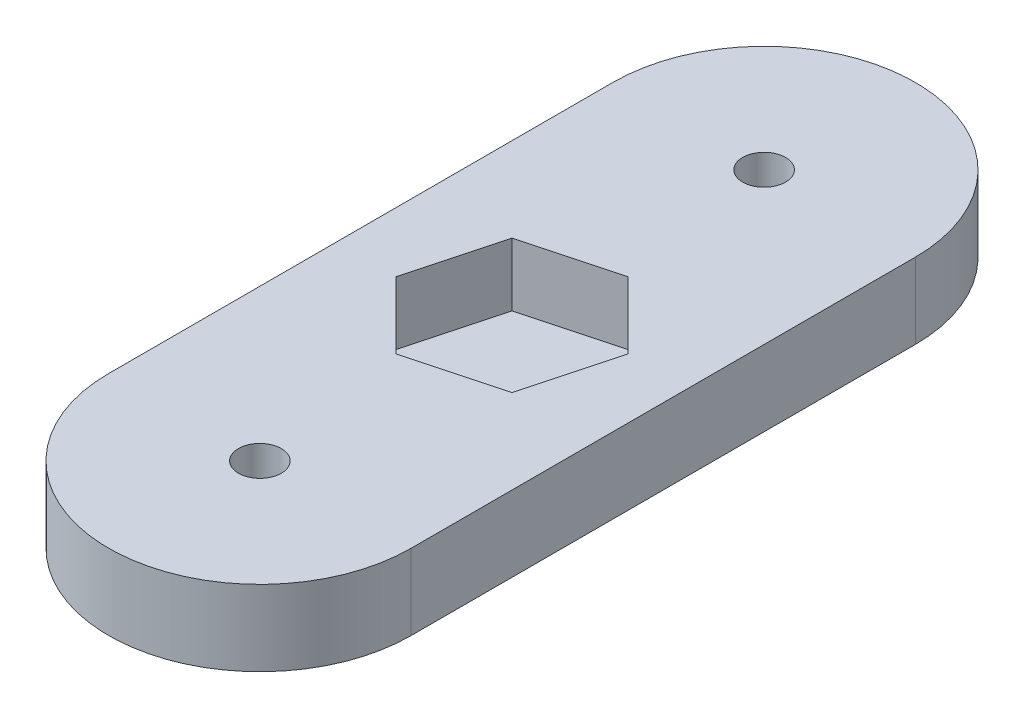
ISO-10303-21;
HEADER;
FILE_DESCRIPTION(('STEP AP214'),'2;1');
FILE_NAME('part.step','',(''),(''),'','','');
FILE_SCHEMA(('AUTOMOTIVE_DESIGN { 1 0 10303 214 1 1 1 1 }'));
ENDSEC;
DATA;
#1=APPLICATION_CONTEXT('core data for automotive mechanical design processes');
#2=APPLICATION_PROTOCOL_DEFINITION('international standard','automotive_design',2000,#1);
#3=PRODUCT_CONTEXT('',#1,'mechanical');
#4=PRODUCT('Part','Part','',(#3));
#5=PRODUCT_RELATED_PRODUCT_CATEGORY('part','',(#4));
#6=PRODUCT_DEFINITION_FORMATION('','',#4);
#7=PRODUCT_DEFINITION_CONTEXT('part definition',#1,'design');
#8=PRODUCT_DEFINITION('design','',#6,#7);
#9=PRODUCT_DEFINITION_SHAPE('','',#8);
#10=(LENGTH_UNIT() NAMED_UNIT(*) SI_UNIT(.MILLI.,.METRE.));
#11=(NAMED_UNIT(*) PLANE_ANGLE_UNIT() SI_UNIT($,.RADIAN.));
#12=(NAMED_UNIT(*) SI_UNIT($,.STERADIAN.) SOLID_ANGLE_UNIT());
#13=UNCERTAINTY_MEASURE_WITH_UNIT(LENGTH_MEASURE(1.E-05),#10,'distance_accuracy_value','');
#14=(GEOMETRIC_REPRESENTATION_CONTEXT(3) GLOBAL_UNCERTAINTY_ASSIGNED_CONTEXT((#13)) GLOBAL_UNIT_ASSIGNED_CONTEXT((#10,
#11,#12)) REPRESENTATION_CONTEXT('',''));
#15=CARTESIAN_POINT('',(0.,0.,0.));
#16=DIRECTION('',(0.,0.,1.));
#17=DIRECTION('',(1.,0.,0.));
#18=AXIS2_PLACEMENT_3D('',#15,#16,#17);
#19=CARTESIAN_POINT('',(0.,6.,0.));
#20=DIRECTION('',(0.,1.,0.));
#21=DIRECTION('',(0.,0.,1.));
#22=AXIS2_PLACEMENT_3D('',#19,#20,#21);
#23=PLANE('',#22);
#24=DIRECTION('',(0.965925826289067,0.,-0.258819045102525));
#25=VECTOR('',#24,1.);
#26=CARTESIAN_POINT('',(-1.94258018969742,6.,-12.7501920342723));
#27=LINE('',#26,#25);
#28=CARTESIAN_POINT('',(-1.94258018969742,6.,-12.7501920342723));
#29=VERTEX_POINT('',#28);
#30=CARTESIAN_POINT('',(5.30722777603024,6.,-14.6927722239698));
#31=VERTEX_POINT('',#30);
#32=EDGE_CURVE('E48',#29,#31,#27,.T.);
#33=ORIENTED_EDGE('',*,*,#32,.F.);
#34=DIRECTION('',(0.70710678118655,0.,0.707106781186545));
#35=VECTOR('',#34,1.);
#36=CARTESIAN_POINT('',(-7.24980796572766,6.,-18.0574198103025));
#37=LINE('',#36,#35);
#38=CARTESIAN_POINT('',(-7.24980796572766,6.,-18.0574198103025));
#39=VERTEX_POINT('',#38);
#40=EDGE_CURVE('E140',#39,#29,#37,.T.);
#41=ORIENTED_EDGE('',*,*,#40,.F.);
#42=DIRECTION('',(-0.258819045102517,0.,0.965925826289069));
#43=VECTOR('',#42,1.);
#44=CARTESIAN_POINT('',(-5.30722777603024,6.,-25.3072277760302));
#45=LINE('',#44,#43);
#46=CARTESIAN_POINT('',(-5.30722777603024,6.,-25.3072277760302));
#47=VERTEX_POINT('',#46);
#48=EDGE_CURVE('E143',#47,#39,#45,.T.);
#49=ORIENTED_EDGE('',*,*,#48,.F.);
#50=DIRECTION('',(-0.965925826289067,0.,0.258819045102525));
#51=VECTOR('',#50,1.);
#52=CARTESIAN_POINT('',(1.94258018969742,6.,-27.2498079657277));
#53=LINE('',#52,#51);
#54=CARTESIAN_POINT('',(1.94258018969742,6.,-27.2498079657277));
#55=VERTEX_POINT('',#54);
#56=EDGE_CURVE('E159',#55,#47,#53,.T.);
#57=ORIENTED_EDGE('',*,*,#56,.F.);
#58=DIRECTION('',(-0.707106781186551,0.,-0.707106781186544));
#59=VECTOR('',#58,1.);
#60=CARTESIAN_POINT('',(7.24980796572766,6.,-21.9425801896975));
#61=LINE('',#60,#59);
#62=CARTESIAN_POINT('',(7.24980796572766,6.,-21.9425801896975));
#63=VERTEX_POINT('',#62);
#64=EDGE_CURVE('E156',#63,#55,#61,.T.);
#65=ORIENTED_EDGE('',*,*,#64,.F.);
#66=DIRECTION('',(0.258819045102517,0.,-0.965925826289069));
#67=VECTOR('',#66,1.);
#68=CARTESIAN_POINT('',(5.30722777603024,6.,-14.6927722239698));
#69=LINE('',#68,#67);
#70=EDGE_CURVE('E154',#31,#63,#69,.T.);
#71=ORIENTED_EDGE('',*,*,#70,.F.);
#72=EDGE_LOOP('',(#33,#41,#49,#57,#65,#71));
#73=FACE_BOUND('',#72,.T.);
#74=CARTESIAN_POINT('',(0.,6.,-40.));
#75=DIRECTION('',(0.,1.,0.));
#76=DIRECTION('',(0.,0.,1.));
#77=AXIS2_PLACEMENT_3D('',#74,#75,#76);
#78=CIRCLE('',#77,1.7);
#79=CARTESIAN_POINT('',(0.,6.,-38.3));
#80=VERTEX_POINT('',#79);
#81=EDGE_CURVE('E180',#80,#80,#78,.T.);
#82=ORIENTED_EDGE('',*,*,#81,.F.);
#83=EDGE_LOOP('',(#82));
#84=FACE_BOUND('',#83,.T.);
#85=CARTESIAN_POINT('',(0.,6.,0.));
#86=DIRECTION('',(0.,1.,0.));
#87=DIRECTION('',(0.,0.,1.));
#88=AXIS2_PLACEMENT_3D('',#85,#86,#87);
#89=CIRCLE('',#88,12.);
#90=CARTESIAN_POINT('',(-12.,6.,0.));
#91=VERTEX_POINT('',#90);
#92=CARTESIAN_POINT('',(12.,6.,0.));
#93=VERTEX_POINT('',#92);
#94=EDGE_CURVE('E186',#91,#93,#89,.T.);
#95=ORIENTED_EDGE('',*,*,#94,.T.);
#96=DIRECTION('',(0.,0.,-1.));
#97=VECTOR('',#96,1.);
#98=CARTESIAN_POINT('',(12.,6.,0.));
#99=LINE('',#98,#97);
#100=CARTESIAN_POINT('',(12.,6.,-40.));
#101=VERTEX_POINT('',#100);
#102=EDGE_CURVE('E85',#93,#101,#99,.T.);
#103=ORIENTED_EDGE('',*,*,#102,.T.);
#104=CARTESIAN_POINT('',(0.,6.,-40.));
#105=DIRECTION('',(0.,1.,0.));
#106=DIRECTION('',(0.,0.,1.));
#107=AXIS2_PLACEMENT_3D('',#104,#105,#106);
#108=CIRCLE('',#107,12.);
#109=CARTESIAN_POINT('',(-12.,6.,-40.));
#110=VERTEX_POINT('',#109);
#111=EDGE_CURVE('E189',#101,#110,#108,.T.);
#112=ORIENTED_EDGE('',*,*,#111,.T.);
#113=DIRECTION('',(0.,0.,1.));
#114=VECTOR('',#113,1.);
#115=CARTESIAN_POINT('',(-12.,6.,0.));
#116=LINE('',#115,#114);
#117=EDGE_CURVE('E57',#110,#91,#116,.T.);
#118=ORIENTED_EDGE('',*,*,#117,.T.);
#119=EDGE_LOOP('',(#95,#103,#112,#118));
#120=FACE_BOUND('',#119,.T.);
#121=CARTESIAN_POINT('',(0.,6.,0.));
#122=DIRECTION('',(0.,1.,0.));
#123=DIRECTION('',(0.,0.,1.));
#124=AXIS2_PLACEMENT_3D('',#121,#122,#123);
#125=CIRCLE('',#124,1.7);
#126=CARTESIAN_POINT('',(0.,6.,1.7));
#127=VERTEX_POINT('',#126);
#128=EDGE_CURVE('E174',#127,#127,#125,.T.);
#129=ORIENTED_EDGE('',*,*,#128,.F.);
#130=EDGE_LOOP('',(#129));
#131=FACE_BOUND('',#130,.T.);
#132=ADVANCED_FACE('F33',(#73,#84,#120,#131),#23,.T.);
#133=CARTESIAN_POINT('',(0.,0.,0.));
#134=DIRECTION('',(0.,1.,0.));
#135=DIRECTION('',(0.,0.,1.));
#136=AXIS2_PLACEMENT_3D('',#133,#134,#135);
#137=PLANE('',#136);
#138=CARTESIAN_POINT('',(0.,0.,-40.));
#139=DIRECTION('',(0.,1.,0.));
#140=DIRECTION('',(0.,0.,1.));
#141=AXIS2_PLACEMENT_3D('',#138,#139,#140);
#142=CIRCLE('',#141,1.7);
#143=CARTESIAN_POINT('',(0.,0.,-38.3));
#144=VERTEX_POINT('',#143);
#145=EDGE_CURVE('E177',#144,#144,#142,.T.);
#146=ORIENTED_EDGE('',*,*,#145,.T.);
#147=EDGE_LOOP('',(#146));
#148=FACE_BOUND('',#147,.T.);
#149=CARTESIAN_POINT('',(0.,0.,0.));
#150=DIRECTION('',(0.,1.,0.));
#151=DIRECTION('',(0.,0.,1.));
#152=AXIS2_PLACEMENT_3D('',#149,#150,#151);
#153=CIRCLE('',#152,12.);
#154=CARTESIAN_POINT('',(-12.,0.,0.));
#155=VERTEX_POINT('',#154);
#156=CARTESIAN_POINT('',(12.,0.,0.));
#157=VERTEX_POINT('',#156);
#158=EDGE_CURVE('E183',#155,#157,#153,.T.);
#159=ORIENTED_EDGE('',*,*,#158,.F.);
#160=DIRECTION('',(0.,0.,1.));
#161=VECTOR('',#160,1.);
#162=CARTESIAN_POINT('',(-12.,0.,0.));
#163=LINE('',#162,#161);
#164=CARTESIAN_POINT('',(-12.,0.,-40.));
#165=VERTEX_POINT('',#164);
#166=EDGE_CURVE('E78',#165,#155,#163,.T.);
#167=ORIENTED_EDGE('',*,*,#166,.F.);
#168=CARTESIAN_POINT('',(0.,0.,-40.));
#169=DIRECTION('',(0.,1.,0.));
#170=DIRECTION('',(0.,0.,1.));
#171=AXIS2_PLACEMENT_3D('',#168,#169,#170);
#172=CIRCLE('',#171,12.);
#173=CARTESIAN_POINT('',(12.,0.,-40.));
#174=VERTEX_POINT('',#173);
#175=EDGE_CURVE('E197',#174,#165,#172,.T.);
#176=ORIENTED_EDGE('',*,*,#175,.F.);
#177=DIRECTION('',(0.,0.,-1.));
#178=VECTOR('',#177,1.);
#179=CARTESIAN_POINT('',(12.,0.,0.));
#180=LINE('',#179,#178);
#181=EDGE_CURVE('E195',#157,#174,#180,.T.);
#182=ORIENTED_EDGE('',*,*,#181,.F.);
#183=EDGE_LOOP('',(#159,#167,#176,#182));
#184=FACE_BOUND('',#183,.T.);
#185=CARTESIAN_POINT('',(0.,0.,0.));
#186=DIRECTION('',(0.,1.,0.));
#187=DIRECTION('',(0.,0.,1.));
#188=AXIS2_PLACEMENT_3D('',#185,#186,#187);
#189=CIRCLE('',#188,1.7);
#190=CARTESIAN_POINT('',(0.,0.,1.7));
#191=VERTEX_POINT('',#190);
#192=EDGE_CURVE('E166',#191,#191,#189,.T.);
#193=ORIENTED_EDGE('',*,*,#192,.T.);
#194=EDGE_LOOP('',(#193));
#195=FACE_BOUND('',#194,.T.);
#196=ADVANCED_FACE('F210',(#148,#184,#195),#137,.F.);
#197=CARTESIAN_POINT('',(0.,6.,0.));
#198=DIRECTION('',(0.,-1.,0.));
#199=DIRECTION('',(0.,0.,-1.));
#200=AXIS2_PLACEMENT_3D('',#197,#198,#199);
#201=CYLINDRICAL_SURFACE('',#200,12.);
#202=ORIENTED_EDGE('',*,*,#158,.T.);
#203=DIRECTION('',(0.,-1.,0.));
#204=VECTOR('',#203,1.);
#205=CARTESIAN_POINT('',(12.,6.,0.));
#206=LINE('',#205,#204);
#207=EDGE_CURVE('E11',#93,#157,#206,.T.);
#208=ORIENTED_EDGE('',*,*,#207,.F.);
#209=ORIENTED_EDGE('',*,*,#94,.F.);
#210=DIRECTION('',(0.,-1.,0.));
#211=VECTOR('',#210,1.);
#212=CARTESIAN_POINT('',(-12.,6.,0.));
#213=LINE('',#212,#211);
#214=EDGE_CURVE('E192',#91,#155,#213,.T.);
#215=ORIENTED_EDGE('',*,*,#214,.T.);
#216=EDGE_LOOP('',(#202,#208,#209,#215));
#217=FACE_BOUND('',#216,.T.);
#218=ADVANCED_FACE('F35',(#217),#201,.T.);
#219=CARTESIAN_POINT('',(12.,6.,0.));
#220=DIRECTION('',(-1.,0.,0.));
#221=DIRECTION('',(0.,0.,1.));
#222=AXIS2_PLACEMENT_3D('',#219,#220,#221);
#223=PLANE('',#222);
#224=ORIENTED_EDGE('',*,*,#181,.T.);
#225=DIRECTION('',(0.,-1.,0.));
#226=VECTOR('',#225,1.);
#227=CARTESIAN_POINT('',(12.,6.,-40.));
#228=LINE('',#227,#226);
#229=EDGE_CURVE('E41',#101,#174,#228,.T.);
#230=ORIENTED_EDGE('',*,*,#229,.F.);
#231=ORIENTED_EDGE('',*,*,#102,.F.);
#232=ORIENTED_EDGE('',*,*,#207,.T.);
#233=EDGE_LOOP('',(#224,#230,#231,#232));
#234=FACE_BOUND('',#233,.T.);
#235=ADVANCED_FACE('F226',(#234),#223,.F.);
#236=CARTESIAN_POINT('',(0.,6.,-40.));
#237=DIRECTION('',(0.,-1.,0.));
#238=DIRECTION('',(0.,0.,-1.));
#239=AXIS2_PLACEMENT_3D('',#236,#237,#238);
#240=CYLINDRICAL_SURFACE('',#239,12.);
#241=ORIENTED_EDGE('',*,*,#175,.T.);
#242=DIRECTION('',(0.,-1.,0.));
#243=VECTOR('',#242,1.);
#244=CARTESIAN_POINT('',(-12.,6.,-40.));
#245=LINE('',#244,#243);
#246=EDGE_CURVE('E201',#110,#165,#245,.T.);
#247=ORIENTED_EDGE('',*,*,#246,.F.);
#248=ORIENTED_EDGE('',*,*,#111,.F.);
#249=ORIENTED_EDGE('',*,*,#229,.T.);
#250=EDGE_LOOP('',(#241,#247,#248,#249));
#251=FACE_BOUND('',#250,.T.);
#252=ADVANCED_FACE('F206',(#251),#240,.T.);
#253=CARTESIAN_POINT('',(-12.,6.,0.));
#254=DIRECTION('',(1.,0.,0.));
#255=DIRECTION('',(0.,0.,-1.));
#256=AXIS2_PLACEMENT_3D('',#253,#254,#255);
#257=PLANE('',#256);
#258=ORIENTED_EDGE('',*,*,#166,.T.);
#259=ORIENTED_EDGE('',*,*,#214,.F.);
#260=ORIENTED_EDGE('',*,*,#117,.F.);
#261=ORIENTED_EDGE('',*,*,#246,.T.);
#262=EDGE_LOOP('',(#258,#259,#260,#261));
#263=FACE_BOUND('',#262,.T.);
#264=ADVANCED_FACE('F215',(#263),#257,.F.);
#265=CARTESIAN_POINT('',(0.,6.,-40.));
#266=DIRECTION('',(0.,-1.,0.));
#267=DIRECTION('',(0.,0.,-1.));
#268=AXIS2_PLACEMENT_3D('',#265,#266,#267);
#269=CYLINDRICAL_SURFACE('',#268,1.7);
#270=ORIENTED_EDGE('',*,*,#81,.T.);
#271=EDGE_LOOP('',(#270));
#272=FACE_BOUND('',#271,.T.);
#273=ORIENTED_EDGE('',*,*,#145,.F.);
#274=EDGE_LOOP('',(#273));
#275=FACE_BOUND('',#274,.T.);
#276=ADVANCED_FACE('F217',(#272,#275),#269,.F.);
#277=CARTESIAN_POINT('',(0.,6.,0.));
#278=DIRECTION('',(0.,-1.,0.));
#279=DIRECTION('',(0.,0.,-1.));
#280=AXIS2_PLACEMENT_3D('',#277,#278,#279);
#281=CYLINDRICAL_SURFACE('',#280,1.7);
#282=ORIENTED_EDGE('',*,*,#128,.T.);
#283=EDGE_LOOP('',(#282));
#284=FACE_BOUND('',#283,.T.);
#285=ORIENTED_EDGE('',*,*,#192,.F.);
#286=EDGE_LOOP('',(#285));
#287=FACE_BOUND('',#286,.T.);
#288=ADVANCED_FACE('F223',(#284,#287),#281,.F.);
#289=CARTESIAN_POINT('',(-1.94258018969742,1.,-12.7501920342723));
#290=DIRECTION('',(0.258819045102525,0.,0.965925826289067));
#291=DIRECTION('',(0.965925826289067,0.,-0.258819045102525));
#292=AXIS2_PLACEMENT_3D('',#289,#290,#291);
#293=PLANE('',#292);
#294=ORIENTED_EDGE('',*,*,#32,.T.);
#295=DIRECTION('',(0.,1.,0.));
#296=VECTOR('',#295,1.);
#297=CARTESIAN_POINT('',(5.30722777603024,1.,-14.6927722239698));
#298=LINE('',#297,#296);
#299=CARTESIAN_POINT('',(5.30722777603024,1.,-14.6927722239698));
#300=VERTEX_POINT('',#299);
#301=EDGE_CURVE('E117',#300,#31,#298,.T.);
#302=ORIENTED_EDGE('',*,*,#301,.F.);
#303=DIRECTION('',(0.965925826289067,0.,-0.258819045102525));
#304=VECTOR('',#303,1.);
#305=CARTESIAN_POINT('',(-1.94258018969742,1.,-12.7501920342723));
#306=LINE('',#305,#304);
#307=CARTESIAN_POINT('',(-1.94258018969742,1.,-12.7501920342723));
#308=VERTEX_POINT('',#307);
#309=EDGE_CURVE('E121',#308,#300,#306,.T.);
#310=ORIENTED_EDGE('',*,*,#309,.F.);
#311=DIRECTION('',(0.,1.,0.));
#312=VECTOR('',#311,1.);
#313=CARTESIAN_POINT('',(-1.94258018969742,1.,-12.7501920342723));
#314=LINE('',#313,#312);
#315=EDGE_CURVE('E164',#308,#29,#314,.T.);
#316=ORIENTED_EDGE('',*,*,#315,.T.);
#317=EDGE_LOOP('',(#294,#302,#310,#316));
#318=FACE_BOUND('',#317,.T.);
#319=ADVANCED_FACE('F119',(#318),#293,.F.);
#320=CARTESIAN_POINT('',(-7.24980796572766,1.,-18.0574198103025));
#321=DIRECTION('',(-0.707106781186545,0.,0.70710678118655));
#322=DIRECTION('',(0.70710678118655,0.,0.707106781186545));
#323=AXIS2_PLACEMENT_3D('',#320,#321,#322);
#324=PLANE('',#323);
#325=ORIENTED_EDGE('',*,*,#40,.T.);
#326=ORIENTED_EDGE('',*,*,#315,.F.);
#327=DIRECTION('',(0.70710678118655,0.,0.707106781186545));
#328=VECTOR('',#327,1.);
#329=CARTESIAN_POINT('',(-7.24980796572766,1.,-18.0574198103025));
#330=LINE('',#329,#328);
#331=CARTESIAN_POINT('',(-7.24980796572766,1.,-18.0574198103025));
#332=VERTEX_POINT('',#331);
#333=EDGE_CURVE('E127',#332,#308,#330,.T.);
#334=ORIENTED_EDGE('',*,*,#333,.F.);
#335=DIRECTION('',(0.,1.,0.));
#336=VECTOR('',#335,1.);
#337=CARTESIAN_POINT('',(-7.24980796572766,1.,-18.0574198103025));
#338=LINE('',#337,#336);
#339=EDGE_CURVE('E167',#332,#39,#338,.T.);
#340=ORIENTED_EDGE('',*,*,#339,.T.);
#341=EDGE_LOOP('',(#325,#326,#334,#340));
#342=FACE_BOUND('',#341,.T.);
#343=ADVANCED_FACE('F243',(#342),#324,.F.);
#344=CARTESIAN_POINT('',(-5.30722777603024,1.,-25.3072277760302));
#345=DIRECTION('',(-0.965925826289069,0.,-0.258819045102517));
#346=DIRECTION('',(-0.258819045102517,0.,0.965925826289069));
#347=AXIS2_PLACEMENT_3D('',#344,#345,#346);
#348=PLANE('',#347);
#349=ORIENTED_EDGE('',*,*,#48,.T.);
#350=ORIENTED_EDGE('',*,*,#339,.F.);
#351=DIRECTION('',(-0.258819045102517,0.,0.965925826289069));
#352=VECTOR('',#351,1.);
#353=CARTESIAN_POINT('',(-5.30722777603024,1.,-25.3072277760302));
#354=LINE('',#353,#352);
#355=CARTESIAN_POINT('',(-5.30722777603024,1.,-25.3072277760302));
#356=VERTEX_POINT('',#355);
#357=EDGE_CURVE('E150',#356,#332,#354,.T.);
#358=ORIENTED_EDGE('',*,*,#357,.F.);
#359=DIRECTION('',(0.,1.,0.));
#360=VECTOR('',#359,1.);
#361=CARTESIAN_POINT('',(-5.30722777603024,1.,-25.3072277760302));
#362=LINE('',#361,#360);
#363=EDGE_CURVE('E169',#356,#47,#362,.T.);
#364=ORIENTED_EDGE('',*,*,#363,.T.);
#365=EDGE_LOOP('',(#349,#350,#358,#364));
#366=FACE_BOUND('',#365,.T.);
#367=ADVANCED_FACE('F253',(#366),#348,.F.);
#368=CARTESIAN_POINT('',(1.94258018969742,1.,-27.2498079657277));
#369=DIRECTION('',(-0.258819045102525,0.,-0.965925826289067));
#370=DIRECTION('',(-0.965925826289067,0.,0.258819045102525));
#371=AXIS2_PLACEMENT_3D('',#368,#369,#370);
#372=PLANE('',#371);
#373=ORIENTED_EDGE('',*,*,#56,.T.);
#374=ORIENTED_EDGE('',*,*,#363,.F.);
#375=DIRECTION('',(-0.965925826289067,0.,0.258819045102525));
#376=VECTOR('',#375,1.);
#377=CARTESIAN_POINT('',(1.94258018969742,1.,-27.2498079657277));
#378=LINE('',#377,#376);
#379=CARTESIAN_POINT('',(1.94258018969742,1.,-27.2498079657277));
#380=VERTEX_POINT('',#379);
#381=EDGE_CURVE('E147',#380,#356,#378,.T.);
#382=ORIENTED_EDGE('',*,*,#381,.F.);
#383=DIRECTION('',(0.,1.,0.));
#384=VECTOR('',#383,1.);
#385=CARTESIAN_POINT('',(1.94258018969742,1.,-27.2498079657277));
#386=LINE('',#385,#384);
#387=EDGE_CURVE('E171',#380,#55,#386,.T.);
#388=ORIENTED_EDGE('',*,*,#387,.T.);
#389=EDGE_LOOP('',(#373,#374,#382,#388));
#390=FACE_BOUND('',#389,.T.);
#391=ADVANCED_FACE('F249',(#390),#372,.F.);
#392=CARTESIAN_POINT('',(7.24980796572766,1.,-21.9425801896975));
#393=DIRECTION('',(0.707106781186544,0.,-0.707106781186551));
#394=DIRECTION('',(-0.707106781186551,0.,-0.707106781186544));
#395=AXIS2_PLACEMENT_3D('',#392,#393,#394);
#396=PLANE('',#395);
#397=ORIENTED_EDGE('',*,*,#64,.T.);
#398=ORIENTED_EDGE('',*,*,#387,.F.);
#399=DIRECTION('',(-0.707106781186551,0.,-0.707106781186544));
#400=VECTOR('',#399,1.);
#401=CARTESIAN_POINT('',(7.24980796572766,1.,-21.9425801896975));
#402=LINE('',#401,#400);
#403=CARTESIAN_POINT('',(7.24980796572766,1.,-21.9425801896975));
#404=VERTEX_POINT('',#403);
#405=EDGE_CURVE('E135',#404,#380,#402,.T.);
#406=ORIENTED_EDGE('',*,*,#405,.F.);
#407=DIRECTION('',(0.,1.,0.));
#408=VECTOR('',#407,1.);
#409=CARTESIAN_POINT('',(7.24980796572766,1.,-21.9425801896975));
#410=LINE('',#409,#408);
#411=EDGE_CURVE('E126',#404,#63,#410,.T.);
#412=ORIENTED_EDGE('',*,*,#411,.T.);
#413=EDGE_LOOP('',(#397,#398,#406,#412));
#414=FACE_BOUND('',#413,.T.);
#415=ADVANCED_FACE('F246',(#414),#396,.F.);
#416=CARTESIAN_POINT('',(5.30722777603024,1.,-14.6927722239698));
#417=DIRECTION('',(0.965925826289069,0.,0.258819045102517));
#418=DIRECTION('',(0.258819045102517,0.,-0.965925826289069));
#419=AXIS2_PLACEMENT_3D('',#416,#417,#418);
#420=PLANE('',#419);
#421=ORIENTED_EDGE('',*,*,#70,.T.);
#422=ORIENTED_EDGE('',*,*,#411,.F.);
#423=DIRECTION('',(0.258819045102517,0.,-0.965925826289069));
#424=VECTOR('',#423,1.);
#425=CARTESIAN_POINT('',(5.30722777603024,1.,-14.6927722239698));
#426=LINE('',#425,#424);
#427=EDGE_CURVE('E130',#300,#404,#426,.T.);
#428=ORIENTED_EDGE('',*,*,#427,.F.);
#429=ORIENTED_EDGE('',*,*,#301,.T.);
#430=EDGE_LOOP('',(#421,#422,#428,#429));
#431=FACE_BOUND('',#430,.T.);
#432=ADVANCED_FACE('F131',(#431),#420,.F.);
#433=CARTESIAN_POINT('',(0.,1.,0.));
#434=DIRECTION('',(0.,1.,0.));
#435=DIRECTION('',(0.,0.,1.));
#436=AXIS2_PLACEMENT_3D('',#433,#434,#435);
#437=PLANE('',#436);
#438=ORIENTED_EDGE('',*,*,#309,.T.);
#439=ORIENTED_EDGE('',*,*,#427,.T.);
#440=ORIENTED_EDGE('',*,*,#405,.T.);
#441=ORIENTED_EDGE('',*,*,#381,.T.);
#442=ORIENTED_EDGE('',*,*,#357,.T.);
#443=ORIENTED_EDGE('',*,*,#333,.T.);
#444=EDGE_LOOP('',(#438,#439,#440,#441,#442,#443));
#445=FACE_BOUND('',#444,.T.);
#446=ADVANCED_FACE('F137',(#445),#437,.T.);
#447=CLOSED_SHELL('',(#132,#196,#218,#235,#252,#264,#276,#288,#319,#343,#367,#391,#415,#432,#446));
#448=MANIFOLD_SOLID_BREP('B2',#447);
#449=ADVANCED_BREP_SHAPE_REPRESENTATION('',(#18,#448),#14);
#450=SHAPE_DEFINITION_REPRESENTATION(#9,#449);
ENDSEC;
END-ISO-10303-21;
